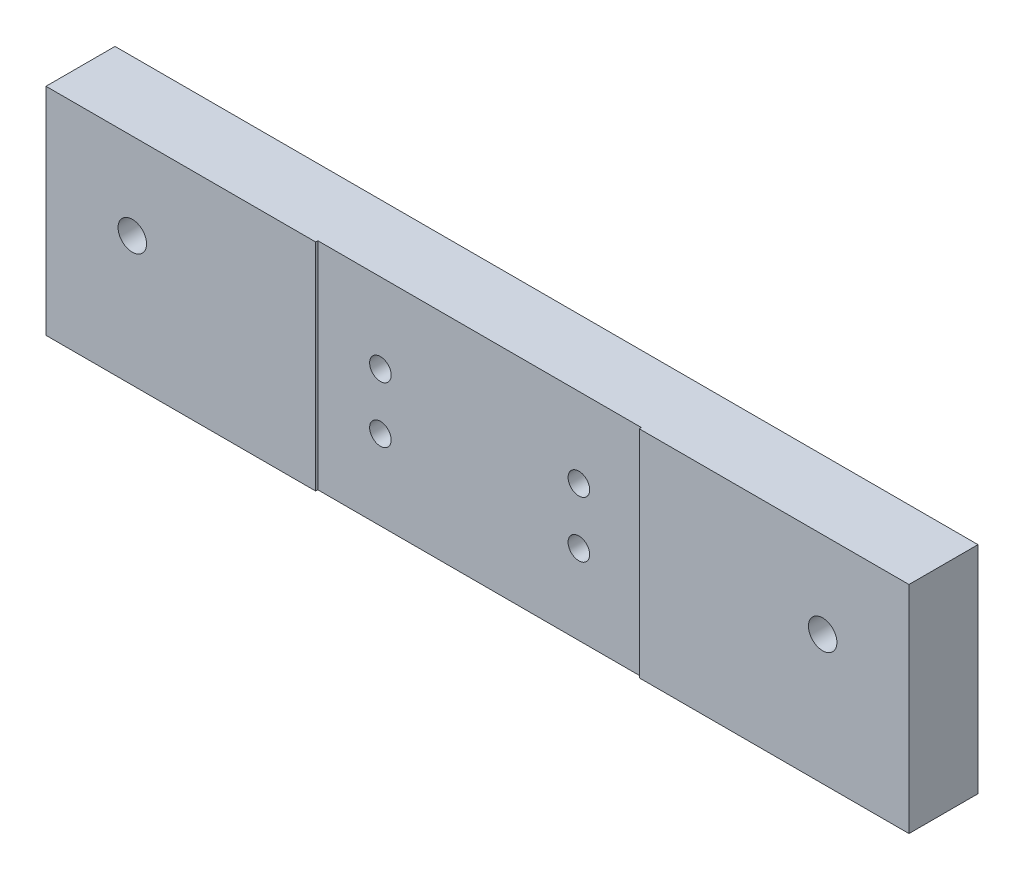
ISO-10303-21;
HEADER;
FILE_DESCRIPTION(('STEP AP214'),'2;1');
FILE_NAME('part.step','',(''),(''),'','','');
FILE_SCHEMA(('AUTOMOTIVE_DESIGN { 1 0 10303 214 1 1 1 1 }'));
ENDSEC;
DATA;
#1=APPLICATION_CONTEXT('core data for automotive mechanical design processes');
#2=APPLICATION_PROTOCOL_DEFINITION('international standard','automotive_design',2000,#1);
#3=PRODUCT_CONTEXT('',#1,'mechanical');
#4=PRODUCT('Part','Part','',(#3));
#5=PRODUCT_RELATED_PRODUCT_CATEGORY('part','',(#4));
#6=PRODUCT_DEFINITION_FORMATION('','',#4);
#7=PRODUCT_DEFINITION_CONTEXT('part definition',#1,'design');
#8=PRODUCT_DEFINITION('design','',#6,#7);
#9=PRODUCT_DEFINITION_SHAPE('','',#8);
#10=(LENGTH_UNIT() NAMED_UNIT(*) SI_UNIT(.MILLI.,.METRE.));
#11=(NAMED_UNIT(*) PLANE_ANGLE_UNIT() SI_UNIT($,.RADIAN.));
#12=(NAMED_UNIT(*) SI_UNIT($,.STERADIAN.) SOLID_ANGLE_UNIT());
#13=UNCERTAINTY_MEASURE_WITH_UNIT(LENGTH_MEASURE(1.E-05),#10,'distance_accuracy_value','');
#14=(GEOMETRIC_REPRESENTATION_CONTEXT(3) GLOBAL_UNCERTAINTY_ASSIGNED_CONTEXT((#13)) GLOBAL_UNIT_ASSIGNED_CONTEXT((#10,
#11,#12)) REPRESENTATION_CONTEXT('',''));
#15=CARTESIAN_POINT('',(0.,0.,0.));
#16=DIRECTION('',(0.,0.,1.));
#17=DIRECTION('',(1.,0.,0.));
#18=AXIS2_PLACEMENT_3D('',#15,#16,#17);
#19=CARTESIAN_POINT('',(0.,0.,16.));
#20=DIRECTION('',(0.,0.,1.));
#21=DIRECTION('',(1.,0.,0.));
#22=AXIS2_PLACEMENT_3D('',#19,#20,#21);
#23=PLANE('',#22);
#24=CARTESIAN_POINT('',(80.,5.,16.));
#25=DIRECTION('',(0.,0.,-1.));
#26=DIRECTION('',(-1.,0.,0.));
#27=AXIS2_PLACEMENT_3D('',#24,#25,#26);
#28=CIRCLE('',#27,3.3);
#29=CARTESIAN_POINT('',(76.7,5.,16.));
#30=VERTEX_POINT('',#29);
#31=EDGE_CURVE('E271',#30,#30,#28,.T.);
#32=ORIENTED_EDGE('',*,*,#31,.T.);
#33=EDGE_LOOP('',(#32));
#34=FACE_BOUND('',#33,.T.);
#35=DIRECTION('',(0.,1.,0.));
#36=VECTOR('',#35,1.);
#37=CARTESIAN_POINT('',(37.5,25.,16.));
#38=LINE('',#37,#36);
#39=CARTESIAN_POINT('',(37.5,-25.,16.));
#40=VERTEX_POINT('',#39);
#41=CARTESIAN_POINT('',(37.5,25.,16.));
#42=VERTEX_POINT('',#41);
#43=EDGE_CURVE('E120',#40,#42,#38,.T.);
#44=ORIENTED_EDGE('',*,*,#43,.F.);
#45=DIRECTION('',(1.,0.,0.));
#46=VECTOR('',#45,1.);
#47=CARTESIAN_POINT('',(-100.,-25.,16.));
#48=LINE('',#47,#46);
#49=CARTESIAN_POINT('',(100.,-25.,16.));
#50=VERTEX_POINT('',#49);
#51=EDGE_CURVE('E65',#40,#50,#48,.T.);
#52=ORIENTED_EDGE('',*,*,#51,.T.);
#53=DIRECTION('',(0.,1.,0.));
#54=VECTOR('',#53,1.);
#55=CARTESIAN_POINT('',(100.,25.,16.));
#56=LINE('',#55,#54);
#57=CARTESIAN_POINT('',(100.,25.,16.));
#58=VERTEX_POINT('',#57);
#59=EDGE_CURVE('E151',#50,#58,#56,.T.);
#60=ORIENTED_EDGE('',*,*,#59,.T.);
#61=DIRECTION('',(-1.,0.,0.));
#62=VECTOR('',#61,1.);
#63=CARTESIAN_POINT('',(-100.,25.,16.));
#64=LINE('',#63,#62);
#65=EDGE_CURVE('E94',#58,#42,#64,.T.);
#66=ORIENTED_EDGE('',*,*,#65,.T.);
#67=EDGE_LOOP('',(#44,#52,#60,#66));
#68=FACE_BOUND('',#67,.T.);
#69=ADVANCED_FACE('F41',(#34,#68),#23,.T.);
#70=CARTESIAN_POINT('',(100.,25.,16.));
#71=DIRECTION('',(-1.,0.,0.));
#72=DIRECTION('',(0.,0.,1.));
#73=AXIS2_PLACEMENT_3D('',#70,#71,#72);
#74=PLANE('',#73);
#75=DIRECTION('',(0.,1.,0.));
#76=VECTOR('',#75,1.);
#77=CARTESIAN_POINT('',(100.,25.,0.));
#78=LINE('',#77,#76);
#79=CARTESIAN_POINT('',(100.,-25.,0.));
#80=VERTEX_POINT('',#79);
#81=CARTESIAN_POINT('',(100.,25.,0.));
#82=VERTEX_POINT('',#81);
#83=EDGE_CURVE('E146',#80,#82,#78,.T.);
#84=ORIENTED_EDGE('',*,*,#83,.T.);
#85=DIRECTION('',(0.,0.,-1.));
#86=VECTOR('',#85,1.);
#87=CARTESIAN_POINT('',(100.,25.,16.));
#88=LINE('',#87,#86);
#89=EDGE_CURVE('E11',#58,#82,#88,.T.);
#90=ORIENTED_EDGE('',*,*,#89,.F.);
#91=ORIENTED_EDGE('',*,*,#59,.F.);
#92=DIRECTION('',(0.,0.,-1.));
#93=VECTOR('',#92,1.);
#94=CARTESIAN_POINT('',(100.,-25.,16.));
#95=LINE('',#94,#93);
#96=EDGE_CURVE('E160',#50,#80,#95,.T.);
#97=ORIENTED_EDGE('',*,*,#96,.T.);
#98=EDGE_LOOP('',(#84,#90,#91,#97));
#99=FACE_BOUND('',#98,.T.);
#100=ADVANCED_FACE('F43',(#99),#74,.F.);
#101=CARTESIAN_POINT('',(-100.,25.,16.));
#102=DIRECTION('',(0.,-1.,0.));
#103=DIRECTION('',(0.,0.,-1.));
#104=AXIS2_PLACEMENT_3D('',#101,#102,#103);
#105=PLANE('',#104);
#106=DIRECTION('',(-1.,0.,0.));
#107=VECTOR('',#106,1.);
#108=CARTESIAN_POINT('',(-37.5,25.,15.5));
#109=LINE('',#108,#107);
#110=CARTESIAN_POINT('',(37.5,25.,15.5));
#111=VERTEX_POINT('',#110);
#112=CARTESIAN_POINT('',(-37.5,25.,15.5));
#113=VERTEX_POINT('',#112);
#114=EDGE_CURVE('E128',#111,#113,#109,.T.);
#115=ORIENTED_EDGE('',*,*,#114,.F.);
#116=DIRECTION('',(0.,0.,1.));
#117=VECTOR('',#116,1.);
#118=CARTESIAN_POINT('',(37.5,25.,15.5));
#119=LINE('',#118,#117);
#120=EDGE_CURVE('E115',#111,#42,#119,.T.);
#121=ORIENTED_EDGE('',*,*,#120,.T.);
#122=ORIENTED_EDGE('',*,*,#65,.F.);
#123=ORIENTED_EDGE('',*,*,#89,.T.);
#124=DIRECTION('',(-1.,0.,0.));
#125=VECTOR('',#124,1.);
#126=CARTESIAN_POINT('',(-100.,25.,0.));
#127=LINE('',#126,#125);
#128=CARTESIAN_POINT('',(-100.,25.,0.));
#129=VERTEX_POINT('',#128);
#130=EDGE_CURVE('E163',#82,#129,#127,.T.);
#131=ORIENTED_EDGE('',*,*,#130,.T.);
#132=DIRECTION('',(0.,0.,-1.));
#133=VECTOR('',#132,1.);
#134=CARTESIAN_POINT('',(-100.,25.,16.));
#135=LINE('',#134,#133);
#136=CARTESIAN_POINT('',(-100.,25.,16.));
#137=VERTEX_POINT('',#136);
#138=EDGE_CURVE('E49',#137,#129,#135,.T.);
#139=ORIENTED_EDGE('',*,*,#138,.F.);
#140=CARTESIAN_POINT('',(-37.5,25.,16.));
#141=VERTEX_POINT('',#140);
#142=EDGE_CURVE('E153',#141,#137,#64,.T.);
#143=ORIENTED_EDGE('',*,*,#142,.F.);
#144=DIRECTION('',(0.,0.,1.));
#145=VECTOR('',#144,1.);
#146=CARTESIAN_POINT('',(-37.5,25.,15.5));
#147=LINE('',#146,#145);
#148=EDGE_CURVE('E56',#113,#141,#147,.T.);
#149=ORIENTED_EDGE('',*,*,#148,.F.);
#150=EDGE_LOOP('',(#115,#121,#122,#123,#131,#139,#143,#149));
#151=FACE_BOUND('',#150,.T.);
#152=ADVANCED_FACE('F133',(#151),#105,.F.);
#153=CARTESIAN_POINT('',(-100.,25.,16.));
#154=DIRECTION('',(1.,0.,0.));
#155=DIRECTION('',(0.,0.,-1.));
#156=AXIS2_PLACEMENT_3D('',#153,#154,#155);
#157=PLANE('',#156);
#158=DIRECTION('',(0.,-1.,0.));
#159=VECTOR('',#158,1.);
#160=CARTESIAN_POINT('',(-100.,25.,0.));
#161=LINE('',#160,#159);
#162=CARTESIAN_POINT('',(-100.,-25.,0.));
#163=VERTEX_POINT('',#162);
#164=EDGE_CURVE('E165',#129,#163,#161,.T.);
#165=ORIENTED_EDGE('',*,*,#164,.T.);
#166=DIRECTION('',(0.,0.,-1.));
#167=VECTOR('',#166,1.);
#168=CARTESIAN_POINT('',(-100.,-25.,16.));
#169=LINE('',#168,#167);
#170=CARTESIAN_POINT('',(-100.,-25.,16.));
#171=VERTEX_POINT('',#170);
#172=EDGE_CURVE('E169',#171,#163,#169,.T.);
#173=ORIENTED_EDGE('',*,*,#172,.F.);
#174=DIRECTION('',(0.,-1.,0.));
#175=VECTOR('',#174,1.);
#176=CARTESIAN_POINT('',(-100.,25.,16.));
#177=LINE('',#176,#175);
#178=EDGE_CURVE('E155',#137,#171,#177,.T.);
#179=ORIENTED_EDGE('',*,*,#178,.F.);
#180=ORIENTED_EDGE('',*,*,#138,.T.);
#181=EDGE_LOOP('',(#165,#173,#179,#180));
#182=FACE_BOUND('',#181,.T.);
#183=ADVANCED_FACE('F175',(#182),#157,.F.);
#184=CARTESIAN_POINT('',(-100.,-25.,16.));
#185=DIRECTION('',(0.,1.,0.));
#186=DIRECTION('',(0.,0.,1.));
#187=AXIS2_PLACEMENT_3D('',#184,#185,#186);
#188=PLANE('',#187);
#189=ORIENTED_EDGE('',*,*,#51,.F.);
#190=DIRECTION('',(0.,0.,1.));
#191=VECTOR('',#190,1.);
#192=CARTESIAN_POINT('',(37.5,-25.,15.5));
#193=LINE('',#192,#191);
#194=CARTESIAN_POINT('',(37.5,-25.,15.5));
#195=VERTEX_POINT('',#194);
#196=EDGE_CURVE('E144',#195,#40,#193,.T.);
#197=ORIENTED_EDGE('',*,*,#196,.F.);
#198=DIRECTION('',(1.,0.,0.));
#199=VECTOR('',#198,1.);
#200=CARTESIAN_POINT('',(-37.5,-25.,15.5));
#201=LINE('',#200,#199);
#202=CARTESIAN_POINT('',(-37.5,-25.,15.5));
#203=VERTEX_POINT('',#202);
#204=EDGE_CURVE('E122',#203,#195,#201,.T.);
#205=ORIENTED_EDGE('',*,*,#204,.F.);
#206=DIRECTION('',(0.,0.,1.));
#207=VECTOR('',#206,1.);
#208=CARTESIAN_POINT('',(-37.5,-25.,15.5));
#209=LINE('',#208,#207);
#210=CARTESIAN_POINT('',(-37.5,-25.,16.));
#211=VERTEX_POINT('',#210);
#212=EDGE_CURVE('E147',#203,#211,#209,.T.);
#213=ORIENTED_EDGE('',*,*,#212,.T.);
#214=EDGE_CURVE('E157',#171,#211,#48,.T.);
#215=ORIENTED_EDGE('',*,*,#214,.F.);
#216=ORIENTED_EDGE('',*,*,#172,.T.);
#217=DIRECTION('',(1.,0.,0.));
#218=VECTOR('',#217,1.);
#219=CARTESIAN_POINT('',(-100.,-25.,0.));
#220=LINE('',#219,#218);
#221=EDGE_CURVE('E87',#163,#80,#220,.T.);
#222=ORIENTED_EDGE('',*,*,#221,.T.);
#223=ORIENTED_EDGE('',*,*,#96,.F.);
#224=EDGE_LOOP('',(#189,#197,#205,#213,#215,#216,#222,#223));
#225=FACE_BOUND('',#224,.T.);
#226=ADVANCED_FACE('F183',(#225),#188,.F.);
#227=CARTESIAN_POINT('',(-80.,5.,16.));
#228=DIRECTION('',(0.,0.,-1.));
#229=DIRECTION('',(-1.,0.,0.));
#230=AXIS2_PLACEMENT_3D('',#227,#228,#229);
#231=CIRCLE('',#230,3.3);
#232=CARTESIAN_POINT('',(-83.3,5.,16.));
#233=VERTEX_POINT('',#232);
#234=EDGE_CURVE('E205',#233,#233,#231,.T.);
#235=ORIENTED_EDGE('',*,*,#234,.T.);
#236=EDGE_LOOP('',(#235));
#237=FACE_BOUND('',#236,.T.);
#238=DIRECTION('',(0.,-1.,0.));
#239=VECTOR('',#238,1.);
#240=CARTESIAN_POINT('',(-37.5,25.,16.));
#241=LINE('',#240,#239);
#242=EDGE_CURVE('E131',#141,#211,#241,.T.);
#243=ORIENTED_EDGE('',*,*,#242,.F.);
#244=ORIENTED_EDGE('',*,*,#142,.T.);
#245=ORIENTED_EDGE('',*,*,#178,.T.);
#246=ORIENTED_EDGE('',*,*,#214,.T.);
#247=EDGE_LOOP('',(#243,#244,#245,#246));
#248=FACE_BOUND('',#247,.T.);
#249=ADVANCED_FACE('F187',(#237,#248),#23,.T.);
#250=CARTESIAN_POINT('',(0.,0.,0.));
#251=DIRECTION('',(0.,0.,1.));
#252=DIRECTION('',(1.,0.,0.));
#253=AXIS2_PLACEMENT_3D('',#250,#251,#252);
#254=PLANE('',#253);
#255=CARTESIAN_POINT('',(80.,5.,0.));
#256=DIRECTION('',(0.,0.,-1.));
#257=DIRECTION('',(-1.,0.,0.));
#258=AXIS2_PLACEMENT_3D('',#255,#256,#257);
#259=CIRCLE('',#258,5.50000000000001);
#260=CARTESIAN_POINT('',(74.5,5.,0.));
#261=VERTEX_POINT('',#260);
#262=EDGE_CURVE('E264',#261,#261,#259,.T.);
#263=ORIENTED_EDGE('',*,*,#262,.F.);
#264=EDGE_LOOP('',(#263));
#265=FACE_BOUND('',#264,.T.);
#266=CARTESIAN_POINT('',(-80.,5.,0.));
#267=DIRECTION('',(0.,0.,-1.));
#268=DIRECTION('',(-1.,0.,0.));
#269=AXIS2_PLACEMENT_3D('',#266,#267,#268);
#270=CIRCLE('',#269,5.50000000000001);
#271=CARTESIAN_POINT('',(-85.5,5.,0.));
#272=VERTEX_POINT('',#271);
#273=EDGE_CURVE('E273',#272,#272,#270,.T.);
#274=ORIENTED_EDGE('',*,*,#273,.F.);
#275=EDGE_LOOP('',(#274));
#276=FACE_BOUND('',#275,.T.);
#277=CARTESIAN_POINT('',(-23.,6.49999999999822,0.));
#278=DIRECTION('',(0.,0.,1.));
#279=DIRECTION('',(1.,0.,0.));
#280=AXIS2_PLACEMENT_3D('',#277,#278,#279);
#281=CIRCLE('',#280,2.5);
#282=CARTESIAN_POINT('',(-20.5,6.49999999999822,0.));
#283=VERTEX_POINT('',#282);
#284=EDGE_CURVE('E286',#283,#283,#281,.T.);
#285=ORIENTED_EDGE('',*,*,#284,.T.);
#286=EDGE_LOOP('',(#285));
#287=FACE_BOUND('',#286,.T.);
#288=CARTESIAN_POINT('',(-23.,-6.50000000000178,0.));
#289=DIRECTION('',(0.,0.,1.));
#290=DIRECTION('',(1.,0.,0.));
#291=AXIS2_PLACEMENT_3D('',#288,#289,#290);
#292=CIRCLE('',#291,2.5);
#293=CARTESIAN_POINT('',(-20.5,-6.50000000000178,0.));
#294=VERTEX_POINT('',#293);
#295=EDGE_CURVE('E292',#294,#294,#292,.T.);
#296=ORIENTED_EDGE('',*,*,#295,.T.);
#297=EDGE_LOOP('',(#296));
#298=FACE_BOUND('',#297,.T.);
#299=CARTESIAN_POINT('',(23.,-6.50000000000178,0.));
#300=DIRECTION('',(0.,0.,1.));
#301=DIRECTION('',(1.,0.,0.));
#302=AXIS2_PLACEMENT_3D('',#299,#300,#301);
#303=CIRCLE('',#302,2.5);
#304=CARTESIAN_POINT('',(25.5,-6.50000000000178,0.));
#305=VERTEX_POINT('',#304);
#306=EDGE_CURVE('E298',#305,#305,#303,.T.);
#307=ORIENTED_EDGE('',*,*,#306,.T.);
#308=EDGE_LOOP('',(#307));
#309=FACE_BOUND('',#308,.T.);
#310=CARTESIAN_POINT('',(23.,6.49999999999822,0.));
#311=DIRECTION('',(0.,0.,1.));
#312=DIRECTION('',(1.,0.,0.));
#313=AXIS2_PLACEMENT_3D('',#310,#311,#312);
#314=CIRCLE('',#313,2.5);
#315=CARTESIAN_POINT('',(25.5,6.49999999999822,0.));
#316=VERTEX_POINT('',#315);
#317=EDGE_CURVE('E142',#316,#316,#314,.T.);
#318=ORIENTED_EDGE('',*,*,#317,.T.);
#319=EDGE_LOOP('',(#318));
#320=FACE_BOUND('',#319,.T.);
#321=ORIENTED_EDGE('',*,*,#83,.F.);
#322=ORIENTED_EDGE('',*,*,#221,.F.);
#323=ORIENTED_EDGE('',*,*,#164,.F.);
#324=ORIENTED_EDGE('',*,*,#130,.F.);
#325=EDGE_LOOP('',(#321,#322,#323,#324));
#326=FACE_BOUND('',#325,.T.);
#327=ADVANCED_FACE('F179',(#265,#276,#287,#298,#309,#320,#326),#254,.F.);
#328=CARTESIAN_POINT('',(37.5,25.,15.5));
#329=DIRECTION('',(1.,0.,0.));
#330=DIRECTION('',(0.,1.,0.));
#331=AXIS2_PLACEMENT_3D('',#328,#329,#330);
#332=PLANE('',#331);
#333=ORIENTED_EDGE('',*,*,#43,.T.);
#334=ORIENTED_EDGE('',*,*,#120,.F.);
#335=DIRECTION('',(0.,1.,0.));
#336=VECTOR('',#335,1.);
#337=CARTESIAN_POINT('',(37.5,25.,15.5));
#338=LINE('',#337,#336);
#339=EDGE_CURVE('E118',#195,#111,#338,.T.);
#340=ORIENTED_EDGE('',*,*,#339,.F.);
#341=ORIENTED_EDGE('',*,*,#196,.T.);
#342=EDGE_LOOP('',(#333,#334,#340,#341));
#343=FACE_BOUND('',#342,.T.);
#344=ADVANCED_FACE('F117',(#343),#332,.F.);
#345=CARTESIAN_POINT('',(-37.5,25.,15.5));
#346=DIRECTION('',(-1.,0.,0.));
#347=DIRECTION('',(0.,0.,1.));
#348=AXIS2_PLACEMENT_3D('',#345,#346,#347);
#349=PLANE('',#348);
#350=ORIENTED_EDGE('',*,*,#242,.T.);
#351=ORIENTED_EDGE('',*,*,#212,.F.);
#352=DIRECTION('',(0.,-1.,0.));
#353=VECTOR('',#352,1.);
#354=CARTESIAN_POINT('',(-37.5,25.,15.5));
#355=LINE('',#354,#353);
#356=EDGE_CURVE('E135',#113,#203,#355,.T.);
#357=ORIENTED_EDGE('',*,*,#356,.F.);
#358=ORIENTED_EDGE('',*,*,#148,.T.);
#359=EDGE_LOOP('',(#350,#351,#357,#358));
#360=FACE_BOUND('',#359,.T.);
#361=ADVANCED_FACE('F207',(#360),#349,.F.);
#362=CARTESIAN_POINT('',(0.,0.,15.5));
#363=DIRECTION('',(0.,0.,1.));
#364=DIRECTION('',(1.,0.,0.));
#365=AXIS2_PLACEMENT_3D('',#362,#363,#364);
#366=PLANE('',#365);
#367=CARTESIAN_POINT('',(-23.,6.49999999999822,15.5));
#368=DIRECTION('',(0.,0.,1.));
#369=DIRECTION('',(1.,0.,0.));
#370=AXIS2_PLACEMENT_3D('',#367,#368,#369);
#371=CIRCLE('',#370,2.49999999999999);
#372=CARTESIAN_POINT('',(-20.5,6.49999999999822,15.5));
#373=VERTEX_POINT('',#372);
#374=EDGE_CURVE('E283',#373,#373,#371,.T.);
#375=ORIENTED_EDGE('',*,*,#374,.F.);
#376=EDGE_LOOP('',(#375));
#377=FACE_BOUND('',#376,.T.);
#378=CARTESIAN_POINT('',(-23.,-6.50000000000178,15.5));
#379=DIRECTION('',(0.,0.,1.));
#380=DIRECTION('',(1.,0.,0.));
#381=AXIS2_PLACEMENT_3D('',#378,#379,#380);
#382=CIRCLE('',#381,2.49999999999999);
#383=CARTESIAN_POINT('',(-20.5,-6.50000000000178,15.5));
#384=VERTEX_POINT('',#383);
#385=EDGE_CURVE('E289',#384,#384,#382,.T.);
#386=ORIENTED_EDGE('',*,*,#385,.F.);
#387=EDGE_LOOP('',(#386));
#388=FACE_BOUND('',#387,.T.);
#389=CARTESIAN_POINT('',(23.,-6.50000000000178,15.5));
#390=DIRECTION('',(0.,0.,1.));
#391=DIRECTION('',(1.,0.,0.));
#392=AXIS2_PLACEMENT_3D('',#389,#390,#391);
#393=CIRCLE('',#392,2.49999999999999);
#394=CARTESIAN_POINT('',(25.5,-6.50000000000178,15.5));
#395=VERTEX_POINT('',#394);
#396=EDGE_CURVE('E295',#395,#395,#393,.T.);
#397=ORIENTED_EDGE('',*,*,#396,.F.);
#398=EDGE_LOOP('',(#397));
#399=FACE_BOUND('',#398,.T.);
#400=CARTESIAN_POINT('',(23.,6.49999999999822,15.5));
#401=DIRECTION('',(0.,0.,1.));
#402=DIRECTION('',(1.,0.,0.));
#403=AXIS2_PLACEMENT_3D('',#400,#401,#402);
#404=CIRCLE('',#403,2.49999999999999);
#405=CARTESIAN_POINT('',(25.5,6.49999999999822,15.5));
#406=VERTEX_POINT('',#405);
#407=EDGE_CURVE('E301',#406,#406,#404,.T.);
#408=ORIENTED_EDGE('',*,*,#407,.F.);
#409=EDGE_LOOP('',(#408));
#410=FACE_BOUND('',#409,.T.);
#411=ORIENTED_EDGE('',*,*,#339,.T.);
#412=ORIENTED_EDGE('',*,*,#114,.T.);
#413=ORIENTED_EDGE('',*,*,#356,.T.);
#414=ORIENTED_EDGE('',*,*,#204,.T.);
#415=EDGE_LOOP('',(#411,#412,#413,#414));
#416=FACE_BOUND('',#415,.T.);
#417=ADVANCED_FACE('F126',(#377,#388,#399,#410,#416),#366,.T.);
#418=CARTESIAN_POINT('',(23.,6.49999999999822,15.5));
#419=DIRECTION('',(0.,0.,1.));
#420=DIRECTION('',(1.,0.,0.));
#421=AXIS2_PLACEMENT_3D('',#418,#419,#420);
#422=CYLINDRICAL_SURFACE('',#421,2.49999999999999);
#423=ORIENTED_EDGE('',*,*,#317,.F.);
#424=EDGE_LOOP('',(#423));
#425=FACE_BOUND('',#424,.T.);
#426=ORIENTED_EDGE('',*,*,#407,.T.);
#427=EDGE_LOOP('',(#426));
#428=FACE_BOUND('',#427,.T.);
#429=ADVANCED_FACE('F214',(#425,#428),#422,.F.);
#430=CARTESIAN_POINT('',(23.,-6.50000000000178,15.5));
#431=DIRECTION('',(0.,0.,1.));
#432=DIRECTION('',(1.,0.,0.));
#433=AXIS2_PLACEMENT_3D('',#430,#431,#432);
#434=CYLINDRICAL_SURFACE('',#433,2.49999999999999);
#435=ORIENTED_EDGE('',*,*,#306,.F.);
#436=EDGE_LOOP('',(#435));
#437=FACE_BOUND('',#436,.T.);
#438=ORIENTED_EDGE('',*,*,#396,.T.);
#439=EDGE_LOOP('',(#438));
#440=FACE_BOUND('',#439,.T.);
#441=ADVANCED_FACE('F220',(#437,#440),#434,.F.);
#442=CARTESIAN_POINT('',(-23.,-6.50000000000178,15.5));
#443=DIRECTION('',(0.,0.,1.));
#444=DIRECTION('',(1.,0.,0.));
#445=AXIS2_PLACEMENT_3D('',#442,#443,#444);
#446=CYLINDRICAL_SURFACE('',#445,2.49999999999999);
#447=ORIENTED_EDGE('',*,*,#295,.F.);
#448=EDGE_LOOP('',(#447));
#449=FACE_BOUND('',#448,.T.);
#450=ORIENTED_EDGE('',*,*,#385,.T.);
#451=EDGE_LOOP('',(#450));
#452=FACE_BOUND('',#451,.T.);
#453=ADVANCED_FACE('F224',(#449,#452),#446,.F.);
#454=CARTESIAN_POINT('',(-23.,6.49999999999822,15.5));
#455=DIRECTION('',(0.,0.,1.));
#456=DIRECTION('',(1.,0.,0.));
#457=AXIS2_PLACEMENT_3D('',#454,#455,#456);
#458=CYLINDRICAL_SURFACE('',#457,2.49999999999999);
#459=ORIENTED_EDGE('',*,*,#284,.F.);
#460=EDGE_LOOP('',(#459));
#461=FACE_BOUND('',#460,.T.);
#462=ORIENTED_EDGE('',*,*,#374,.T.);
#463=EDGE_LOOP('',(#462));
#464=FACE_BOUND('',#463,.T.);
#465=ADVANCED_FACE('F228',(#461,#464),#458,.F.);
#466=CARTESIAN_POINT('',(-80.,5.,0.));
#467=DIRECTION('',(0.,0.,-1.));
#468=DIRECTION('',(-1.,0.,0.));
#469=AXIS2_PLACEMENT_3D('',#466,#467,#468);
#470=CYLINDRICAL_SURFACE('',#469,3.3);
#471=ORIENTED_EDGE('',*,*,#234,.F.);
#472=EDGE_LOOP('',(#471));
#473=FACE_BOUND('',#472,.T.);
#474=CARTESIAN_POINT('',(-80.,5.,6.4));
#475=DIRECTION('',(0.,0.,-1.));
#476=DIRECTION('',(-1.,0.,0.));
#477=AXIS2_PLACEMENT_3D('',#474,#475,#476);
#478=CIRCLE('',#477,3.3);
#479=CARTESIAN_POINT('',(-83.3,5.,6.4));
#480=VERTEX_POINT('',#479);
#481=EDGE_CURVE('E279',#480,#480,#478,.T.);
#482=ORIENTED_EDGE('',*,*,#481,.T.);
#483=EDGE_LOOP('',(#482));
#484=FACE_BOUND('',#483,.T.);
#485=ADVANCED_FACE('F232',(#473,#484),#470,.F.);
#486=CARTESIAN_POINT('',(-76.7,5.,6.4));
#487=DIRECTION('',(0.,0.,1.));
#488=DIRECTION('',(1.,0.,0.));
#489=AXIS2_PLACEMENT_3D('',#486,#487,#488);
#490=PLANE('',#489);
#491=ORIENTED_EDGE('',*,*,#481,.F.);
#492=EDGE_LOOP('',(#491));
#493=FACE_BOUND('',#492,.T.);
#494=CARTESIAN_POINT('',(-80.,5.,6.4));
#495=DIRECTION('',(0.,0.,-1.));
#496=DIRECTION('',(-1.,0.,0.));
#497=AXIS2_PLACEMENT_3D('',#494,#495,#496);
#498=CIRCLE('',#497,5.49999999999999);
#499=CARTESIAN_POINT('',(-85.5,5.,6.4));
#500=VERTEX_POINT('',#499);
#501=EDGE_CURVE('E276',#500,#500,#498,.T.);
#502=ORIENTED_EDGE('',*,*,#501,.T.);
#503=EDGE_LOOP('',(#502));
#504=FACE_BOUND('',#503,.T.);
#505=ADVANCED_FACE('F236',(#493,#504),#490,.F.);
#506=CARTESIAN_POINT('',(-80.,5.,0.));
#507=DIRECTION('',(0.,0.,-1.));
#508=DIRECTION('',(-1.,0.,0.));
#509=AXIS2_PLACEMENT_3D('',#506,#507,#508);
#510=CYLINDRICAL_SURFACE('',#509,5.5);
#511=ORIENTED_EDGE('',*,*,#501,.F.);
#512=EDGE_LOOP('',(#511));
#513=FACE_BOUND('',#512,.T.);
#514=ORIENTED_EDGE('',*,*,#273,.T.);
#515=EDGE_LOOP('',(#514));
#516=FACE_BOUND('',#515,.T.);
#517=ADVANCED_FACE('F240',(#513,#516),#510,.F.);
#518=CARTESIAN_POINT('',(80.,5.,0.));
#519=DIRECTION('',(0.,0.,-1.));
#520=DIRECTION('',(-1.,0.,0.));
#521=AXIS2_PLACEMENT_3D('',#518,#519,#520);
#522=CYLINDRICAL_SURFACE('',#521,3.3);
#523=ORIENTED_EDGE('',*,*,#31,.F.);
#524=EDGE_LOOP('',(#523));
#525=FACE_BOUND('',#524,.T.);
#526=CARTESIAN_POINT('',(80.,5.,6.4));
#527=DIRECTION('',(0.,0.,-1.));
#528=DIRECTION('',(-1.,0.,0.));
#529=AXIS2_PLACEMENT_3D('',#526,#527,#528);
#530=CIRCLE('',#529,3.3);
#531=CARTESIAN_POINT('',(76.7,5.,6.4));
#532=VERTEX_POINT('',#531);
#533=EDGE_CURVE('E266',#532,#532,#530,.T.);
#534=ORIENTED_EDGE('',*,*,#533,.T.);
#535=EDGE_LOOP('',(#534));
#536=FACE_BOUND('',#535,.T.);
#537=ADVANCED_FACE('F244',(#525,#536),#522,.F.);
#538=CARTESIAN_POINT('',(83.3,5.,6.4));
#539=DIRECTION('',(0.,0.,1.));
#540=DIRECTION('',(1.,0.,0.));
#541=AXIS2_PLACEMENT_3D('',#538,#539,#540);
#542=PLANE('',#541);
#543=ORIENTED_EDGE('',*,*,#533,.F.);
#544=EDGE_LOOP('',(#543));
#545=FACE_BOUND('',#544,.T.);
#546=CARTESIAN_POINT('',(80.,5.,6.4));
#547=DIRECTION('',(0.,0.,-1.));
#548=DIRECTION('',(-1.,0.,0.));
#549=AXIS2_PLACEMENT_3D('',#546,#547,#548);
#550=CIRCLE('',#549,5.49999999999999);
#551=CARTESIAN_POINT('',(74.5,5.,6.4));
#552=VERTEX_POINT('',#551);
#553=EDGE_CURVE('E261',#552,#552,#550,.T.);
#554=ORIENTED_EDGE('',*,*,#553,.T.);
#555=EDGE_LOOP('',(#554));
#556=FACE_BOUND('',#555,.T.);
#557=ADVANCED_FACE('F248',(#545,#556),#542,.F.);
#558=CARTESIAN_POINT('',(80.,5.,0.));
#559=DIRECTION('',(0.,0.,-1.));
#560=DIRECTION('',(-1.,0.,0.));
#561=AXIS2_PLACEMENT_3D('',#558,#559,#560);
#562=CYLINDRICAL_SURFACE('',#561,5.5);
#563=ORIENTED_EDGE('',*,*,#553,.F.);
#564=EDGE_LOOP('',(#563));
#565=FACE_BOUND('',#564,.T.);
#566=ORIENTED_EDGE('',*,*,#262,.T.);
#567=EDGE_LOOP('',(#566));
#568=FACE_BOUND('',#567,.T.);
#569=ADVANCED_FACE('F252',(#565,#568),#562,.F.);
#570=CLOSED_SHELL('',(#69,#100,#152,#183,#226,#249,#327,#344,#361,#417,#429,#441,#453,#465,#485,
#505,#517,#537,#557,#569));
#571=MANIFOLD_SOLID_BREP('B2',#570);
#572=ADVANCED_BREP_SHAPE_REPRESENTATION('',(#18,#571),#14);
#573=SHAPE_DEFINITION_REPRESENTATION(#9,#572);
ENDSEC;
END-ISO-10303-21;
